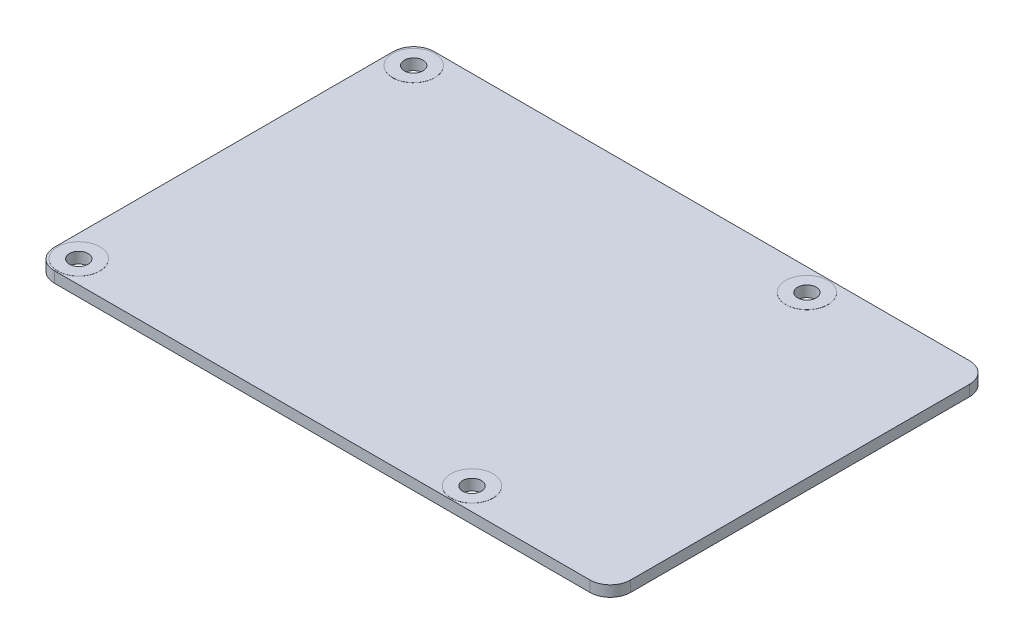
ISO-10303-21;
HEADER;
FILE_DESCRIPTION(('STEP AP214'),'2;1');
FILE_NAME('part.step','',(''),(''),'','','');
FILE_SCHEMA(('AUTOMOTIVE_DESIGN { 1 0 10303 214 1 1 1 1 }'));
ENDSEC;
DATA;
#1=APPLICATION_CONTEXT('core data for automotive mechanical design processes');
#2=APPLICATION_PROTOCOL_DEFINITION('international standard','automotive_design',2000,#1);
#3=PRODUCT_CONTEXT('',#1,'mechanical');
#4=PRODUCT('Part','Part','',(#3));
#5=PRODUCT_RELATED_PRODUCT_CATEGORY('part','',(#4));
#6=PRODUCT_DEFINITION_FORMATION('','',#4);
#7=PRODUCT_DEFINITION_CONTEXT('part definition',#1,'design');
#8=PRODUCT_DEFINITION('design','',#6,#7);
#9=PRODUCT_DEFINITION_SHAPE('','',#8);
#10=(LENGTH_UNIT() NAMED_UNIT(*) SI_UNIT(.MILLI.,.METRE.));
#11=(NAMED_UNIT(*) PLANE_ANGLE_UNIT() SI_UNIT($,.RADIAN.));
#12=(NAMED_UNIT(*) SI_UNIT($,.STERADIAN.) SOLID_ANGLE_UNIT());
#13=UNCERTAINTY_MEASURE_WITH_UNIT(LENGTH_MEASURE(1.E-05),#10,'distance_accuracy_value','');
#14=(GEOMETRIC_REPRESENTATION_CONTEXT(3) GLOBAL_UNCERTAINTY_ASSIGNED_CONTEXT((#13)) GLOBAL_UNIT_ASSIGNED_CONTEXT((#10,
#11,#12)) REPRESENTATION_CONTEXT('',''));
#15=CARTESIAN_POINT('',(0.,0.,0.));
#16=DIRECTION('',(0.,0.,1.));
#17=DIRECTION('',(1.,0.,0.));
#18=AXIS2_PLACEMENT_3D('',#15,#16,#17);
#19=CARTESIAN_POINT('',(3.,0.8,-3.));
#20=DIRECTION('',(0.,1.,0.));
#21=DIRECTION('',(0.,0.,1.));
#22=AXIS2_PLACEMENT_3D('',#19,#20,#21);
#23=PLANE('',#22);
#24=CARTESIAN_POINT('',(3.30000000000001,0.8,-3.3));
#25=DIRECTION('',(0.,1.,0.));
#26=DIRECTION('',(0.,0.,1.));
#27=AXIS2_PLACEMENT_3D('',#24,#25,#26);
#28=CIRCLE('',#27,3.1);
#29=CARTESIAN_POINT('',(3.30000000000001,0.8,-0.2));
#30=VERTEX_POINT('',#29);
#31=EDGE_CURVE('E291',#30,#30,#28,.T.);
#32=ORIENTED_EDGE('',*,*,#31,.F.);
#33=EDGE_LOOP('',(#32));
#34=FACE_BOUND('',#33,.T.);
#35=CARTESIAN_POINT('',(61.3,0.8,-52.7));
#36=DIRECTION('',(0.,1.,0.));
#37=DIRECTION('',(0.,0.,1.));
#38=AXIS2_PLACEMENT_3D('',#35,#36,#37);
#39=CIRCLE('',#38,3.09999999999999);
#40=CARTESIAN_POINT('',(61.3,0.8,-49.6));
#41=VERTEX_POINT('',#40);
#42=EDGE_CURVE('E245',#41,#41,#39,.T.);
#43=ORIENTED_EDGE('',*,*,#42,.F.);
#44=EDGE_LOOP('',(#43));
#45=FACE_BOUND('',#44,.T.);
#46=CARTESIAN_POINT('',(3.,0.8,-3.));
#47=DIRECTION('',(0.,1.,0.));
#48=DIRECTION('',(0.,0.,1.));
#49=AXIS2_PLACEMENT_3D('',#46,#47,#48);
#50=CIRCLE('',#49,3.);
#51=CARTESIAN_POINT('',(0.,0.8,-3.00000000000002));
#52=VERTEX_POINT('',#51);
#53=CARTESIAN_POINT('',(3.00000000000002,0.8,0.));
#54=VERTEX_POINT('',#53);
#55=EDGE_CURVE('E259',#52,#54,#50,.T.);
#56=ORIENTED_EDGE('',*,*,#55,.T.);
#57=DIRECTION('',(1.,0.,0.));
#58=VECTOR('',#57,1.);
#59=CARTESIAN_POINT('',(3.00000000000002,0.8,0.));
#60=LINE('',#59,#58);
#61=CARTESIAN_POINT('',(82.,0.8,0.));
#62=VERTEX_POINT('',#61);
#63=EDGE_CURVE('E201',#54,#62,#60,.T.);
#64=ORIENTED_EDGE('',*,*,#63,.T.);
#65=CARTESIAN_POINT('',(82.,0.8,-3.));
#66=DIRECTION('',(0.,1.,0.));
#67=DIRECTION('',(0.,0.,1.));
#68=AXIS2_PLACEMENT_3D('',#65,#66,#67);
#69=CIRCLE('',#68,3.);
#70=CARTESIAN_POINT('',(85.,0.8,-3.00000000000002));
#71=VERTEX_POINT('',#70);
#72=EDGE_CURVE('E272',#62,#71,#69,.T.);
#73=ORIENTED_EDGE('',*,*,#72,.T.);
#74=DIRECTION('',(0.,0.,1.));
#75=VECTOR('',#74,1.);
#76=CARTESIAN_POINT('',(85.,0.8,-53.));
#77=LINE('',#76,#75);
#78=CARTESIAN_POINT('',(85.,0.8,-53.));
#79=VERTEX_POINT('',#78);
#80=EDGE_CURVE('E235',#79,#71,#77,.T.);
#81=ORIENTED_EDGE('',*,*,#80,.F.);
#82=CARTESIAN_POINT('',(82.,0.8,-53.));
#83=DIRECTION('',(0.,-1.,0.));
#84=DIRECTION('',(0.,0.,-1.));
#85=AXIS2_PLACEMENT_3D('',#82,#83,#84);
#86=CIRCLE('',#85,3.);
#87=CARTESIAN_POINT('',(82.,0.8,-56.));
#88=VERTEX_POINT('',#87);
#89=EDGE_CURVE('E233',#88,#79,#86,.T.);
#90=ORIENTED_EDGE('',*,*,#89,.F.);
#91=DIRECTION('',(1.,0.,0.));
#92=VECTOR('',#91,1.);
#93=CARTESIAN_POINT('',(3.00000000000002,0.8,-56.));
#94=LINE('',#93,#92);
#95=CARTESIAN_POINT('',(3.00000000000002,0.8,-56.));
#96=VERTEX_POINT('',#95);
#97=EDGE_CURVE('E220',#96,#88,#94,.T.);
#98=ORIENTED_EDGE('',*,*,#97,.F.);
#99=CARTESIAN_POINT('',(3.,0.8,-53.));
#100=DIRECTION('',(0.,1.,0.));
#101=DIRECTION('',(0.,0.,1.));
#102=AXIS2_PLACEMENT_3D('',#99,#100,#101);
#103=CIRCLE('',#102,3.);
#104=CARTESIAN_POINT('',(0.,0.8,-53.));
#105=VERTEX_POINT('',#104);
#106=EDGE_CURVE('E226',#96,#105,#103,.T.);
#107=ORIENTED_EDGE('',*,*,#106,.T.);
#108=DIRECTION('',(0.,0.,1.));
#109=VECTOR('',#108,1.);
#110=CARTESIAN_POINT('',(0.,0.8,-53.));
#111=LINE('',#110,#109);
#112=EDGE_CURVE('E159',#105,#52,#111,.T.);
#113=ORIENTED_EDGE('',*,*,#112,.T.);
#114=EDGE_LOOP('',(#56,#64,#73,#81,#90,#98,#107,#113));
#115=FACE_BOUND('',#114,.T.);
#116=CARTESIAN_POINT('',(61.3,0.8,-3.3));
#117=DIRECTION('',(0.,1.,0.));
#118=DIRECTION('',(0.,0.,1.));
#119=AXIS2_PLACEMENT_3D('',#116,#117,#118);
#120=CIRCLE('',#119,3.1);
#121=CARTESIAN_POINT('',(61.3,0.8,-0.199999999999998));
#122=VERTEX_POINT('',#121);
#123=EDGE_CURVE('E288',#122,#122,#120,.T.);
#124=ORIENTED_EDGE('',*,*,#123,.F.);
#125=EDGE_LOOP('',(#124));
#126=FACE_BOUND('',#125,.T.);
#127=CARTESIAN_POINT('',(3.3,0.8,-52.7));
#128=DIRECTION('',(0.,1.,0.));
#129=DIRECTION('',(0.,0.,1.));
#130=AXIS2_PLACEMENT_3D('',#127,#128,#129);
#131=CIRCLE('',#130,3.1);
#132=CARTESIAN_POINT('',(3.3,0.8,-49.6));
#133=VERTEX_POINT('',#132);
#134=EDGE_CURVE('E294',#133,#133,#131,.T.);
#135=ORIENTED_EDGE('',*,*,#134,.F.);
#136=EDGE_LOOP('',(#135));
#137=FACE_BOUND('',#136,.T.);
#138=ADVANCED_FACE('F142',(#34,#45,#115,#126,#137),#23,.T.);
#139=CARTESIAN_POINT('',(3.,-0.8,-3.));
#140=DIRECTION('',(0.,1.,0.));
#141=DIRECTION('',(0.,0.,1.));
#142=AXIS2_PLACEMENT_3D('',#139,#140,#141);
#143=PLANE('',#142);
#144=CARTESIAN_POINT('',(3.,-0.8,-3.));
#145=DIRECTION('',(0.,1.,0.));
#146=DIRECTION('',(0.,0.,1.));
#147=AXIS2_PLACEMENT_3D('',#144,#145,#146);
#148=CIRCLE('',#147,3.);
#149=CARTESIAN_POINT('',(0.,-0.8,-3.00000000000002));
#150=VERTEX_POINT('',#149);
#151=CARTESIAN_POINT('',(3.00000000000002,-0.8,0.));
#152=VERTEX_POINT('',#151);
#153=EDGE_CURVE('E241',#150,#152,#148,.T.);
#154=ORIENTED_EDGE('',*,*,#153,.F.);
#155=DIRECTION('',(0.,0.,1.));
#156=VECTOR('',#155,1.);
#157=CARTESIAN_POINT('',(0.,-0.8,-53.));
#158=LINE('',#157,#156);
#159=CARTESIAN_POINT('',(0.,-0.8,-53.));
#160=VERTEX_POINT('',#159);
#161=EDGE_CURVE('E193',#160,#150,#158,.T.);
#162=ORIENTED_EDGE('',*,*,#161,.F.);
#163=CARTESIAN_POINT('',(3.,-0.8,-53.));
#164=DIRECTION('',(0.,1.,0.));
#165=DIRECTION('',(0.,0.,1.));
#166=AXIS2_PLACEMENT_3D('',#163,#164,#165);
#167=CIRCLE('',#166,3.);
#168=CARTESIAN_POINT('',(3.00000000000002,-0.8,-56.));
#169=VERTEX_POINT('',#168);
#170=EDGE_CURVE('E187',#169,#160,#167,.T.);
#171=ORIENTED_EDGE('',*,*,#170,.F.);
#172=DIRECTION('',(1.,0.,0.));
#173=VECTOR('',#172,1.);
#174=CARTESIAN_POINT('',(3.00000000000002,-0.8,-56.));
#175=LINE('',#174,#173);
#176=CARTESIAN_POINT('',(82.,-0.8,-56.));
#177=VERTEX_POINT('',#176);
#178=EDGE_CURVE('E222',#169,#177,#175,.T.);
#179=ORIENTED_EDGE('',*,*,#178,.T.);
#180=CARTESIAN_POINT('',(82.,-0.8,-53.));
#181=DIRECTION('',(0.,-1.,0.));
#182=DIRECTION('',(0.,0.,-1.));
#183=AXIS2_PLACEMENT_3D('',#180,#181,#182);
#184=CIRCLE('',#183,3.);
#185=CARTESIAN_POINT('',(85.,-0.8,-53.));
#186=VERTEX_POINT('',#185);
#187=EDGE_CURVE('E253',#177,#186,#184,.T.);
#188=ORIENTED_EDGE('',*,*,#187,.T.);
#189=DIRECTION('',(0.,0.,1.));
#190=VECTOR('',#189,1.);
#191=CARTESIAN_POINT('',(85.,-0.8,-53.));
#192=LINE('',#191,#190);
#193=CARTESIAN_POINT('',(85.,-0.8,-3.00000000000002));
#194=VERTEX_POINT('',#193);
#195=EDGE_CURVE('E250',#186,#194,#192,.T.);
#196=ORIENTED_EDGE('',*,*,#195,.T.);
#197=CARTESIAN_POINT('',(82.,-0.8,-3.));
#198=DIRECTION('',(0.,1.,0.));
#199=DIRECTION('',(0.,0.,1.));
#200=AXIS2_PLACEMENT_3D('',#197,#198,#199);
#201=CIRCLE('',#200,3.);
#202=CARTESIAN_POINT('',(82.,-0.8,0.));
#203=VERTEX_POINT('',#202);
#204=EDGE_CURVE('E247',#203,#194,#201,.T.);
#205=ORIENTED_EDGE('',*,*,#204,.F.);
#206=DIRECTION('',(1.,0.,0.));
#207=VECTOR('',#206,1.);
#208=CARTESIAN_POINT('',(3.00000000000002,-0.8,0.));
#209=LINE('',#208,#207);
#210=EDGE_CURVE('E244',#152,#203,#209,.T.);
#211=ORIENTED_EDGE('',*,*,#210,.F.);
#212=EDGE_LOOP('',(#154,#162,#171,#179,#188,#196,#205,#211));
#213=FACE_BOUND('',#212,.T.);
#214=CARTESIAN_POINT('',(61.3,-0.8,-52.7));
#215=DIRECTION('',(0.,1.,0.));
#216=DIRECTION('',(0.,0.,1.));
#217=AXIS2_PLACEMENT_3D('',#214,#215,#216);
#218=CIRCLE('',#217,3.10000000000009);
#219=CARTESIAN_POINT('',(61.3,-0.8,-49.5999999999999));
#220=VERTEX_POINT('',#219);
#221=EDGE_CURVE('E325',#220,#220,#218,.F.);
#222=ORIENTED_EDGE('',*,*,#221,.F.);
#223=EDGE_LOOP('',(#222));
#224=FACE_BOUND('',#223,.T.);
#225=CARTESIAN_POINT('',(61.3,-0.8,-3.3));
#226=DIRECTION('',(0.,1.,0.));
#227=DIRECTION('',(0.,0.,1.));
#228=AXIS2_PLACEMENT_3D('',#225,#226,#227);
#229=CIRCLE('',#228,3.09999999999998);
#230=CARTESIAN_POINT('',(61.3,-0.8,-0.200000000000023));
#231=VERTEX_POINT('',#230);
#232=EDGE_CURVE('E310',#231,#231,#229,.F.);
#233=ORIENTED_EDGE('',*,*,#232,.F.);
#234=EDGE_LOOP('',(#233));
#235=FACE_BOUND('',#234,.T.);
#236=CARTESIAN_POINT('',(3.30000000000001,-0.8,-3.3));
#237=DIRECTION('',(0.,1.,0.));
#238=DIRECTION('',(0.,0.,1.));
#239=AXIS2_PLACEMENT_3D('',#236,#237,#238);
#240=CIRCLE('',#239,3.1);
#241=CARTESIAN_POINT('',(3.30000000000001,-0.8,-0.199999999999998));
#242=VERTEX_POINT('',#241);
#243=EDGE_CURVE('E297',#242,#242,#240,.F.);
#244=ORIENTED_EDGE('',*,*,#243,.F.);
#245=EDGE_LOOP('',(#244));
#246=FACE_BOUND('',#245,.T.);
#247=CARTESIAN_POINT('',(3.30000000000001,-0.8,-52.7));
#248=DIRECTION('',(0.,1.,0.));
#249=DIRECTION('',(0.,0.,1.));
#250=AXIS2_PLACEMENT_3D('',#247,#248,#249);
#251=CIRCLE('',#250,3.10000000000001);
#252=CARTESIAN_POINT('',(3.30000000000001,-0.8,-49.6));
#253=VERTEX_POINT('',#252);
#254=EDGE_CURVE('E340',#253,#253,#251,.F.);
#255=ORIENTED_EDGE('',*,*,#254,.F.);
#256=EDGE_LOOP('',(#255));
#257=FACE_BOUND('',#256,.T.);
#258=ADVANCED_FACE('F275',(#213,#224,#235,#246,#257),#143,.F.);
#259=CARTESIAN_POINT('',(3.,0.8,-3.));
#260=DIRECTION('',(0.,-1.,0.));
#261=DIRECTION('',(0.,0.,-1.));
#262=AXIS2_PLACEMENT_3D('',#259,#260,#261);
#263=CYLINDRICAL_SURFACE('',#262,3.);
#264=ORIENTED_EDGE('',*,*,#153,.T.);
#265=DIRECTION('',(0.,-1.,0.));
#266=VECTOR('',#265,1.);
#267=CARTESIAN_POINT('',(3.00000000000002,0.8,0.));
#268=LINE('',#267,#266);
#269=EDGE_CURVE('E12',#54,#152,#268,.T.);
#270=ORIENTED_EDGE('',*,*,#269,.F.);
#271=ORIENTED_EDGE('',*,*,#55,.F.);
#272=DIRECTION('',(0.,-1.,0.));
#273=VECTOR('',#272,1.);
#274=CARTESIAN_POINT('',(0.,0.8,-3.00000000000002));
#275=LINE('',#274,#273);
#276=EDGE_CURVE('E240',#52,#150,#275,.T.);
#277=ORIENTED_EDGE('',*,*,#276,.T.);
#278=EDGE_LOOP('',(#264,#270,#271,#277));
#279=FACE_BOUND('',#278,.T.);
#280=ADVANCED_FACE('F144',(#279),#263,.T.);
#281=CARTESIAN_POINT('',(3.00000000000002,0.8,0.));
#282=DIRECTION('',(0.,0.,-1.));
#283=DIRECTION('',(-1.,0.,0.));
#284=AXIS2_PLACEMENT_3D('',#281,#282,#283);
#285=PLANE('',#284);
#286=ORIENTED_EDGE('',*,*,#210,.T.);
#287=DIRECTION('',(0.,-1.,0.));
#288=VECTOR('',#287,1.);
#289=CARTESIAN_POINT('',(82.,0.8,0.));
#290=LINE('',#289,#288);
#291=EDGE_CURVE('E151',#62,#203,#290,.T.);
#292=ORIENTED_EDGE('',*,*,#291,.F.);
#293=ORIENTED_EDGE('',*,*,#63,.F.);
#294=ORIENTED_EDGE('',*,*,#269,.T.);
#295=EDGE_LOOP('',(#286,#292,#293,#294));
#296=FACE_BOUND('',#295,.T.);
#297=ADVANCED_FACE('F406',(#296),#285,.F.);
#298=CARTESIAN_POINT('',(82.,0.8,-3.));
#299=DIRECTION('',(0.,-1.,0.));
#300=DIRECTION('',(0.,0.,-1.));
#301=AXIS2_PLACEMENT_3D('',#298,#299,#300);
#302=CYLINDRICAL_SURFACE('',#301,3.);
#303=ORIENTED_EDGE('',*,*,#204,.T.);
#304=DIRECTION('',(0.,-1.,0.));
#305=VECTOR('',#304,1.);
#306=CARTESIAN_POINT('',(85.,0.8,-3.00000000000002));
#307=LINE('',#306,#305);
#308=EDGE_CURVE('E265',#71,#194,#307,.T.);
#309=ORIENTED_EDGE('',*,*,#308,.F.);
#310=ORIENTED_EDGE('',*,*,#72,.F.);
#311=ORIENTED_EDGE('',*,*,#291,.T.);
#312=EDGE_LOOP('',(#303,#309,#310,#311));
#313=FACE_BOUND('',#312,.T.);
#314=ADVANCED_FACE('F270',(#313),#302,.T.);
#315=CARTESIAN_POINT('',(85.,0.8,-53.));
#316=DIRECTION('',(1.,0.,0.));
#317=DIRECTION('',(0.,0.,-1.));
#318=AXIS2_PLACEMENT_3D('',#315,#316,#317);
#319=PLANE('',#318);
#320=ORIENTED_EDGE('',*,*,#195,.F.);
#321=DIRECTION('',(0.,-1.,0.));
#322=VECTOR('',#321,1.);
#323=CARTESIAN_POINT('',(85.,0.8,-53.));
#324=LINE('',#323,#322);
#325=EDGE_CURVE('E263',#79,#186,#324,.T.);
#326=ORIENTED_EDGE('',*,*,#325,.F.);
#327=ORIENTED_EDGE('',*,*,#80,.T.);
#328=ORIENTED_EDGE('',*,*,#308,.T.);
#329=EDGE_LOOP('',(#320,#326,#327,#328));
#330=FACE_BOUND('',#329,.T.);
#331=ADVANCED_FACE('F280',(#330),#319,.T.);
#332=CARTESIAN_POINT('',(82.,0.8,-53.));
#333=DIRECTION('',(0.,-1.,0.));
#334=DIRECTION('',(0.,0.,-1.));
#335=AXIS2_PLACEMENT_3D('',#332,#333,#334);
#336=CYLINDRICAL_SURFACE('',#335,3.);
#337=ORIENTED_EDGE('',*,*,#187,.F.);
#338=DIRECTION('',(0.,-1.,0.));
#339=VECTOR('',#338,1.);
#340=CARTESIAN_POINT('',(82.,0.8,-56.));
#341=LINE('',#340,#339);
#342=EDGE_CURVE('E223',#88,#177,#341,.T.);
#343=ORIENTED_EDGE('',*,*,#342,.F.);
#344=ORIENTED_EDGE('',*,*,#89,.T.);
#345=ORIENTED_EDGE('',*,*,#325,.T.);
#346=EDGE_LOOP('',(#337,#343,#344,#345));
#347=FACE_BOUND('',#346,.T.);
#348=ADVANCED_FACE('F399',(#347),#336,.T.);
#349=CARTESIAN_POINT('',(3.00000000000002,0.8,-56.));
#350=DIRECTION('',(0.,0.,-1.));
#351=DIRECTION('',(-1.,0.,0.));
#352=AXIS2_PLACEMENT_3D('',#349,#350,#351);
#353=PLANE('',#352);
#354=ORIENTED_EDGE('',*,*,#178,.F.);
#355=DIRECTION('',(0.,-1.,0.));
#356=VECTOR('',#355,1.);
#357=CARTESIAN_POINT('',(3.00000000000002,0.8,-56.));
#358=LINE('',#357,#356);
#359=EDGE_CURVE('E216',#96,#169,#358,.T.);
#360=ORIENTED_EDGE('',*,*,#359,.F.);
#361=ORIENTED_EDGE('',*,*,#97,.T.);
#362=ORIENTED_EDGE('',*,*,#342,.T.);
#363=EDGE_LOOP('',(#354,#360,#361,#362));
#364=FACE_BOUND('',#363,.T.);
#365=ADVANCED_FACE('F218',(#364),#353,.T.);
#366=CARTESIAN_POINT('',(3.,0.8,-53.));
#367=DIRECTION('',(0.,-1.,0.));
#368=DIRECTION('',(0.,0.,-1.));
#369=AXIS2_PLACEMENT_3D('',#366,#367,#368);
#370=CYLINDRICAL_SURFACE('',#369,3.);
#371=ORIENTED_EDGE('',*,*,#170,.T.);
#372=DIRECTION('',(0.,-1.,0.));
#373=VECTOR('',#372,1.);
#374=CARTESIAN_POINT('',(0.,0.8,-53.));
#375=LINE('',#374,#373);
#376=EDGE_CURVE('E224',#105,#160,#375,.T.);
#377=ORIENTED_EDGE('',*,*,#376,.F.);
#378=ORIENTED_EDGE('',*,*,#106,.F.);
#379=ORIENTED_EDGE('',*,*,#359,.T.);
#380=EDGE_LOOP('',(#371,#377,#378,#379));
#381=FACE_BOUND('',#380,.T.);
#382=ADVANCED_FACE('F227',(#381),#370,.T.);
#383=CARTESIAN_POINT('',(0.,0.8,-53.));
#384=DIRECTION('',(1.,0.,0.));
#385=DIRECTION('',(0.,0.,-1.));
#386=AXIS2_PLACEMENT_3D('',#383,#384,#385);
#387=PLANE('',#386);
#388=ORIENTED_EDGE('',*,*,#161,.T.);
#389=ORIENTED_EDGE('',*,*,#276,.F.);
#390=ORIENTED_EDGE('',*,*,#112,.F.);
#391=ORIENTED_EDGE('',*,*,#376,.T.);
#392=EDGE_LOOP('',(#388,#389,#390,#391));
#393=FACE_BOUND('',#392,.T.);
#394=ADVANCED_FACE('F391',(#393),#387,.F.);
#395=CARTESIAN_POINT('',(3.30000000000001,0.815,-3.3));
#396=DIRECTION('',(0.,-1.,0.));
#397=DIRECTION('',(0.,0.,-1.));
#398=AXIS2_PLACEMENT_3D('',#395,#396,#397);
#399=CYLINDRICAL_SURFACE('',#398,3.1);
#400=CARTESIAN_POINT('',(3.30000000000001,-0.815,-3.3));
#401=DIRECTION('',(0.,1.,0.));
#402=DIRECTION('',(0.,0.,1.));
#403=AXIS2_PLACEMENT_3D('',#400,#401,#402);
#404=CIRCLE('',#403,3.1);
#405=CARTESIAN_POINT('',(3.30000000000001,-0.815,-0.199999999999998));
#406=VERTEX_POINT('',#405);
#407=EDGE_CURVE('E301',#406,#406,#404,.T.);
#408=ORIENTED_EDGE('',*,*,#407,.T.);
#409=EDGE_LOOP('',(#408));
#410=FACE_BOUND('',#409,.T.);
#411=ORIENTED_EDGE('',*,*,#243,.T.);
#412=EDGE_LOOP('',(#411));
#413=FACE_BOUND('',#412,.T.);
#414=ADVANCED_FACE('F394',(#410,#413),#399,.T.);
#415=CARTESIAN_POINT('',(3.30000000000001,0.815,-3.3));
#416=DIRECTION('',(0.,1.,0.));
#417=DIRECTION('',(0.,0.,1.));
#418=AXIS2_PLACEMENT_3D('',#415,#416,#417);
#419=PLANE('',#418);
#420=CARTESIAN_POINT('',(3.30000000000001,0.815,-3.3));
#421=DIRECTION('',(0.,1.,0.));
#422=DIRECTION('',(0.,0.,1.));
#423=AXIS2_PLACEMENT_3D('',#420,#421,#422);
#424=CIRCLE('',#423,3.1);
#425=CARTESIAN_POINT('',(3.30000000000001,0.815,-0.199999999999998));
#426=VERTEX_POINT('',#425);
#427=EDGE_CURVE('E300',#426,#426,#424,.T.);
#428=ORIENTED_EDGE('',*,*,#427,.T.);
#429=EDGE_LOOP('',(#428));
#430=FACE_BOUND('',#429,.T.);
#431=CARTESIAN_POINT('',(3.30000000000001,0.815,-3.3));
#432=DIRECTION('',(0.,1.,0.));
#433=DIRECTION('',(0.,0.,1.));
#434=AXIS2_PLACEMENT_3D('',#431,#432,#433);
#435=CIRCLE('',#434,1.375);
#436=CARTESIAN_POINT('',(3.30000000000001,0.815,-1.925));
#437=VERTEX_POINT('',#436);
#438=EDGE_CURVE('E304',#437,#437,#435,.T.);
#439=ORIENTED_EDGE('',*,*,#438,.F.);
#440=EDGE_LOOP('',(#439));
#441=FACE_BOUND('',#440,.T.);
#442=ADVANCED_FACE('F472',(#430,#441),#419,.T.);
#443=CARTESIAN_POINT('',(3.30000000000001,-0.815,-3.3));
#444=DIRECTION('',(0.,1.,0.));
#445=DIRECTION('',(0.,0.,1.));
#446=AXIS2_PLACEMENT_3D('',#443,#444,#445);
#447=PLANE('',#446);
#448=ORIENTED_EDGE('',*,*,#407,.F.);
#449=EDGE_LOOP('',(#448));
#450=FACE_BOUND('',#449,.T.);
#451=CARTESIAN_POINT('',(3.30000000000001,-0.815,-3.3));
#452=DIRECTION('',(0.,1.,0.));
#453=DIRECTION('',(0.,0.,1.));
#454=AXIS2_PLACEMENT_3D('',#451,#452,#453);
#455=CIRCLE('',#454,1.375);
#456=CARTESIAN_POINT('',(3.30000000000001,-0.815,-1.925));
#457=VERTEX_POINT('',#456);
#458=EDGE_CURVE('E307',#457,#457,#455,.T.);
#459=ORIENTED_EDGE('',*,*,#458,.T.);
#460=EDGE_LOOP('',(#459));
#461=FACE_BOUND('',#460,.T.);
#462=ADVANCED_FACE('F480',(#450,#461),#447,.F.);
#463=ORIENTED_EDGE('',*,*,#31,.T.);
#464=EDGE_LOOP('',(#463));
#465=FACE_BOUND('',#464,.T.);
#466=ORIENTED_EDGE('',*,*,#427,.F.);
#467=EDGE_LOOP('',(#466));
#468=FACE_BOUND('',#467,.T.);
#469=ADVANCED_FACE('F388',(#465,#468),#399,.T.);
#470=CARTESIAN_POINT('',(3.30000000000001,0.815,-3.3));
#471=DIRECTION('',(0.,-1.,0.));
#472=DIRECTION('',(0.,0.,-1.));
#473=AXIS2_PLACEMENT_3D('',#470,#471,#472);
#474=CYLINDRICAL_SURFACE('',#473,1.375);
#475=ORIENTED_EDGE('',*,*,#438,.T.);
#476=EDGE_LOOP('',(#475));
#477=FACE_BOUND('',#476,.T.);
#478=ORIENTED_EDGE('',*,*,#458,.F.);
#479=EDGE_LOOP('',(#478));
#480=FACE_BOUND('',#479,.T.);
#481=ADVANCED_FACE('F496',(#477,#480),#474,.F.);
#482=CARTESIAN_POINT('',(61.3,0.815,-3.3));
#483=DIRECTION('',(0.,-1.,0.));
#484=DIRECTION('',(0.,0.,-1.));
#485=AXIS2_PLACEMENT_3D('',#482,#483,#484);
#486=CYLINDRICAL_SURFACE('',#485,3.09999999999998);
#487=CARTESIAN_POINT('',(61.3,-0.815,-3.3));
#488=DIRECTION('',(0.,1.,0.));
#489=DIRECTION('',(0.,0.,1.));
#490=AXIS2_PLACEMENT_3D('',#487,#488,#489);
#491=CIRCLE('',#490,3.09999999999998);
#492=CARTESIAN_POINT('',(61.3,-0.815,-0.200000000000023));
#493=VERTEX_POINT('',#492);
#494=EDGE_CURVE('E316',#493,#493,#491,.T.);
#495=ORIENTED_EDGE('',*,*,#494,.T.);
#496=EDGE_LOOP('',(#495));
#497=FACE_BOUND('',#496,.T.);
#498=ORIENTED_EDGE('',*,*,#232,.T.);
#499=EDGE_LOOP('',(#498));
#500=FACE_BOUND('',#499,.T.);
#501=ADVANCED_FACE('F504',(#497,#500),#486,.T.);
#502=CARTESIAN_POINT('',(61.3,0.815,-3.3));
#503=DIRECTION('',(0.,1.,0.));
#504=DIRECTION('',(0.,0.,1.));
#505=AXIS2_PLACEMENT_3D('',#502,#503,#504);
#506=PLANE('',#505);
#507=CARTESIAN_POINT('',(61.3,0.815,-3.3));
#508=DIRECTION('',(0.,1.,0.));
#509=DIRECTION('',(0.,0.,1.));
#510=AXIS2_PLACEMENT_3D('',#507,#508,#509);
#511=CIRCLE('',#510,3.09999999999998);
#512=CARTESIAN_POINT('',(61.3,0.815,-0.200000000000023));
#513=VERTEX_POINT('',#512);
#514=EDGE_CURVE('E315',#513,#513,#511,.T.);
#515=ORIENTED_EDGE('',*,*,#514,.T.);
#516=EDGE_LOOP('',(#515));
#517=FACE_BOUND('',#516,.T.);
#518=CARTESIAN_POINT('',(61.3,0.815,-3.3));
#519=DIRECTION('',(0.,1.,0.));
#520=DIRECTION('',(0.,0.,1.));
#521=AXIS2_PLACEMENT_3D('',#518,#519,#520);
#522=CIRCLE('',#521,1.375);
#523=CARTESIAN_POINT('',(61.3,0.815,-1.92500000000001));
#524=VERTEX_POINT('',#523);
#525=EDGE_CURVE('E319',#524,#524,#522,.T.);
#526=ORIENTED_EDGE('',*,*,#525,.F.);
#527=EDGE_LOOP('',(#526));
#528=FACE_BOUND('',#527,.T.);
#529=ADVANCED_FACE('F513',(#517,#528),#506,.T.);
#530=CARTESIAN_POINT('',(61.3,-0.815,-3.3));
#531=DIRECTION('',(0.,1.,0.));
#532=DIRECTION('',(0.,0.,1.));
#533=AXIS2_PLACEMENT_3D('',#530,#531,#532);
#534=PLANE('',#533);
#535=ORIENTED_EDGE('',*,*,#494,.F.);
#536=EDGE_LOOP('',(#535));
#537=FACE_BOUND('',#536,.T.);
#538=CARTESIAN_POINT('',(61.3,-0.815,-3.3));
#539=DIRECTION('',(0.,1.,0.));
#540=DIRECTION('',(0.,0.,1.));
#541=AXIS2_PLACEMENT_3D('',#538,#539,#540);
#542=CIRCLE('',#541,1.375);
#543=CARTESIAN_POINT('',(61.3,-0.815,-1.92500000000001));
#544=VERTEX_POINT('',#543);
#545=EDGE_CURVE('E322',#544,#544,#542,.T.);
#546=ORIENTED_EDGE('',*,*,#545,.T.);
#547=EDGE_LOOP('',(#546));
#548=FACE_BOUND('',#547,.T.);
#549=ADVANCED_FACE('F523',(#537,#548),#534,.F.);
#550=ORIENTED_EDGE('',*,*,#123,.T.);
#551=EDGE_LOOP('',(#550));
#552=FACE_BOUND('',#551,.T.);
#553=ORIENTED_EDGE('',*,*,#514,.F.);
#554=EDGE_LOOP('',(#553));
#555=FACE_BOUND('',#554,.T.);
#556=ADVANCED_FACE('F516',(#552,#555),#486,.T.);
#557=CARTESIAN_POINT('',(61.3,0.815,-3.3));
#558=DIRECTION('',(0.,-1.,0.));
#559=DIRECTION('',(0.,0.,-1.));
#560=AXIS2_PLACEMENT_3D('',#557,#558,#559);
#561=CYLINDRICAL_SURFACE('',#560,1.375);
#562=ORIENTED_EDGE('',*,*,#525,.T.);
#563=EDGE_LOOP('',(#562));
#564=FACE_BOUND('',#563,.T.);
#565=ORIENTED_EDGE('',*,*,#545,.F.);
#566=EDGE_LOOP('',(#565));
#567=FACE_BOUND('',#566,.T.);
#568=ADVANCED_FACE('F540',(#564,#567),#561,.F.);
#569=CARTESIAN_POINT('',(61.3,0.815,-52.7));
#570=DIRECTION('',(0.,-1.,0.));
#571=DIRECTION('',(0.,0.,-1.));
#572=AXIS2_PLACEMENT_3D('',#569,#570,#571);
#573=CYLINDRICAL_SURFACE('',#572,3.10000000000009);
#574=CARTESIAN_POINT('',(61.3,-0.815,-52.7));
#575=DIRECTION('',(0.,1.,0.));
#576=DIRECTION('',(0.,0.,1.));
#577=AXIS2_PLACEMENT_3D('',#574,#575,#576);
#578=CIRCLE('',#577,3.10000000000009);
#579=CARTESIAN_POINT('',(61.3,-0.815,-49.5999999999999));
#580=VERTEX_POINT('',#579);
#581=EDGE_CURVE('E331',#580,#580,#578,.T.);
#582=ORIENTED_EDGE('',*,*,#581,.T.);
#583=EDGE_LOOP('',(#582));
#584=FACE_BOUND('',#583,.T.);
#585=ORIENTED_EDGE('',*,*,#221,.T.);
#586=EDGE_LOOP('',(#585));
#587=FACE_BOUND('',#586,.T.);
#588=ADVANCED_FACE('F548',(#584,#587),#573,.T.);
#589=CARTESIAN_POINT('',(61.3,0.815,-52.7));
#590=DIRECTION('',(0.,1.,0.));
#591=DIRECTION('',(0.,0.,1.));
#592=AXIS2_PLACEMENT_3D('',#589,#590,#591);
#593=PLANE('',#592);
#594=CARTESIAN_POINT('',(61.3,0.815,-52.7));
#595=DIRECTION('',(0.,1.,0.));
#596=DIRECTION('',(0.,0.,1.));
#597=AXIS2_PLACEMENT_3D('',#594,#595,#596);
#598=CIRCLE('',#597,3.10000000000009);
#599=CARTESIAN_POINT('',(61.3,0.815,-49.5999999999999));
#600=VERTEX_POINT('',#599);
#601=EDGE_CURVE('E330',#600,#600,#598,.T.);
#602=ORIENTED_EDGE('',*,*,#601,.T.);
#603=EDGE_LOOP('',(#602));
#604=FACE_BOUND('',#603,.T.);
#605=CARTESIAN_POINT('',(61.3,0.815,-52.7));
#606=DIRECTION('',(0.,1.,0.));
#607=DIRECTION('',(0.,0.,1.));
#608=AXIS2_PLACEMENT_3D('',#605,#606,#607);
#609=CIRCLE('',#608,1.375);
#610=CARTESIAN_POINT('',(61.3,0.815,-51.325));
#611=VERTEX_POINT('',#610);
#612=EDGE_CURVE('E334',#611,#611,#609,.T.);
#613=ORIENTED_EDGE('',*,*,#612,.F.);
#614=EDGE_LOOP('',(#613));
#615=FACE_BOUND('',#614,.T.);
#616=ADVANCED_FACE('F557',(#604,#615),#593,.T.);
#617=CARTESIAN_POINT('',(61.3,-0.815,-52.7));
#618=DIRECTION('',(0.,1.,0.));
#619=DIRECTION('',(0.,0.,1.));
#620=AXIS2_PLACEMENT_3D('',#617,#618,#619);
#621=PLANE('',#620);
#622=ORIENTED_EDGE('',*,*,#581,.F.);
#623=EDGE_LOOP('',(#622));
#624=FACE_BOUND('',#623,.T.);
#625=CARTESIAN_POINT('',(61.3,-0.815,-52.7));
#626=DIRECTION('',(0.,1.,0.));
#627=DIRECTION('',(0.,0.,1.));
#628=AXIS2_PLACEMENT_3D('',#625,#626,#627);
#629=CIRCLE('',#628,1.375);
#630=CARTESIAN_POINT('',(61.3,-0.815,-51.325));
#631=VERTEX_POINT('',#630);
#632=EDGE_CURVE('E337',#631,#631,#629,.T.);
#633=ORIENTED_EDGE('',*,*,#632,.T.);
#634=EDGE_LOOP('',(#633));
#635=FACE_BOUND('',#634,.T.);
#636=ADVANCED_FACE('F567',(#624,#635),#621,.F.);
#637=ORIENTED_EDGE('',*,*,#42,.T.);
#638=EDGE_LOOP('',(#637));
#639=FACE_BOUND('',#638,.T.);
#640=ORIENTED_EDGE('',*,*,#601,.F.);
#641=EDGE_LOOP('',(#640));
#642=FACE_BOUND('',#641,.T.);
#643=ADVANCED_FACE('F560',(#639,#642),#573,.T.);
#644=CARTESIAN_POINT('',(61.3,0.815,-52.7));
#645=DIRECTION('',(0.,-1.,0.));
#646=DIRECTION('',(0.,0.,-1.));
#647=AXIS2_PLACEMENT_3D('',#644,#645,#646);
#648=CYLINDRICAL_SURFACE('',#647,1.375);
#649=ORIENTED_EDGE('',*,*,#612,.T.);
#650=EDGE_LOOP('',(#649));
#651=FACE_BOUND('',#650,.T.);
#652=ORIENTED_EDGE('',*,*,#632,.F.);
#653=EDGE_LOOP('',(#652));
#654=FACE_BOUND('',#653,.T.);
#655=ADVANCED_FACE('F374',(#651,#654),#648,.F.);
#656=CARTESIAN_POINT('',(3.30000000000001,0.815,-52.7));
#657=DIRECTION('',(0.,-1.,0.));
#658=DIRECTION('',(0.,0.,-1.));
#659=AXIS2_PLACEMENT_3D('',#656,#657,#658);
#660=CYLINDRICAL_SURFACE('',#659,3.10000000000001);
#661=CARTESIAN_POINT('',(3.30000000000001,-0.815,-52.7));
#662=DIRECTION('',(0.,1.,0.));
#663=DIRECTION('',(0.,0.,1.));
#664=AXIS2_PLACEMENT_3D('',#661,#662,#663);
#665=CIRCLE('',#664,3.10000000000001);
#666=CARTESIAN_POINT('',(3.30000000000001,-0.815,-49.6));
#667=VERTEX_POINT('',#666);
#668=EDGE_CURVE('E346',#667,#667,#665,.T.);
#669=ORIENTED_EDGE('',*,*,#668,.T.);
#670=EDGE_LOOP('',(#669));
#671=FACE_BOUND('',#670,.T.);
#672=ORIENTED_EDGE('',*,*,#254,.T.);
#673=EDGE_LOOP('',(#672));
#674=FACE_BOUND('',#673,.T.);
#675=ADVANCED_FACE('F364',(#671,#674),#660,.T.);
#676=CARTESIAN_POINT('',(3.30000000000001,0.815,-52.7));
#677=DIRECTION('',(0.,1.,0.));
#678=DIRECTION('',(0.,0.,1.));
#679=AXIS2_PLACEMENT_3D('',#676,#677,#678);
#680=PLANE('',#679);
#681=CARTESIAN_POINT('',(3.30000000000001,0.815,-52.7));
#682=DIRECTION('',(0.,1.,0.));
#683=DIRECTION('',(0.,0.,1.));
#684=AXIS2_PLACEMENT_3D('',#681,#682,#683);
#685=CIRCLE('',#684,3.10000000000001);
#686=CARTESIAN_POINT('',(3.30000000000001,0.815,-49.6));
#687=VERTEX_POINT('',#686);
#688=EDGE_CURVE('E345',#687,#687,#685,.T.);
#689=ORIENTED_EDGE('',*,*,#688,.T.);
#690=EDGE_LOOP('',(#689));
#691=FACE_BOUND('',#690,.T.);
#692=CARTESIAN_POINT('',(3.30000000000001,0.815,-52.7));
#693=DIRECTION('',(0.,1.,0.));
#694=DIRECTION('',(0.,0.,1.));
#695=AXIS2_PLACEMENT_3D('',#692,#693,#694);
#696=CIRCLE('',#695,1.375);
#697=CARTESIAN_POINT('',(3.30000000000001,0.815,-51.325));
#698=VERTEX_POINT('',#697);
#699=EDGE_CURVE('E349',#698,#698,#696,.T.);
#700=ORIENTED_EDGE('',*,*,#699,.F.);
#701=EDGE_LOOP('',(#700));
#702=FACE_BOUND('',#701,.T.);
#703=ADVANCED_FACE('F361',(#691,#702),#680,.T.);
#704=CARTESIAN_POINT('',(3.30000000000001,-0.815,-52.7));
#705=DIRECTION('',(0.,1.,0.));
#706=DIRECTION('',(0.,0.,1.));
#707=AXIS2_PLACEMENT_3D('',#704,#705,#706);
#708=PLANE('',#707);
#709=ORIENTED_EDGE('',*,*,#668,.F.);
#710=EDGE_LOOP('',(#709));
#711=FACE_BOUND('',#710,.T.);
#712=CARTESIAN_POINT('',(3.30000000000001,-0.815,-52.7));
#713=DIRECTION('',(0.,1.,0.));
#714=DIRECTION('',(0.,0.,1.));
#715=AXIS2_PLACEMENT_3D('',#712,#713,#714);
#716=CIRCLE('',#715,1.375);
#717=CARTESIAN_POINT('',(3.30000000000001,-0.815,-51.325));
#718=VERTEX_POINT('',#717);
#719=EDGE_CURVE('E352',#718,#718,#716,.T.);
#720=ORIENTED_EDGE('',*,*,#719,.T.);
#721=EDGE_LOOP('',(#720));
#722=FACE_BOUND('',#721,.T.);
#723=ADVANCED_FACE('F363',(#711,#722),#708,.F.);
#724=ORIENTED_EDGE('',*,*,#134,.T.);
#725=EDGE_LOOP('',(#724));
#726=FACE_BOUND('',#725,.T.);
#727=ORIENTED_EDGE('',*,*,#688,.F.);
#728=EDGE_LOOP('',(#727));
#729=FACE_BOUND('',#728,.T.);
#730=ADVANCED_FACE('F371',(#726,#729),#660,.T.);
#731=CARTESIAN_POINT('',(3.30000000000001,0.815,-52.7));
#732=DIRECTION('',(0.,-1.,0.));
#733=DIRECTION('',(0.,0.,-1.));
#734=AXIS2_PLACEMENT_3D('',#731,#732,#733);
#735=CYLINDRICAL_SURFACE('',#734,1.375);
#736=ORIENTED_EDGE('',*,*,#699,.T.);
#737=EDGE_LOOP('',(#736));
#738=FACE_BOUND('',#737,.T.);
#739=ORIENTED_EDGE('',*,*,#719,.F.);
#740=EDGE_LOOP('',(#739));
#741=FACE_BOUND('',#740,.T.);
#742=ADVANCED_FACE('F358',(#738,#741),#735,.F.);
#743=CLOSED_SHELL('',(#138,#258,#280,#297,#314,#331,#348,#365,#382,#394,#414,#442,#462,#469,
#481,#501,#529,#549,#556,#568,#588,#616,#636,#643,#655,#675,#703,#723,#730,#742));
#744=MANIFOLD_SOLID_BREP('B2',#743);
#745=ADVANCED_BREP_SHAPE_REPRESENTATION('',(#18,#744),#14);
#746=SHAPE_DEFINITION_REPRESENTATION(#9,#745);
ENDSEC;
END-ISO-10303-21;
